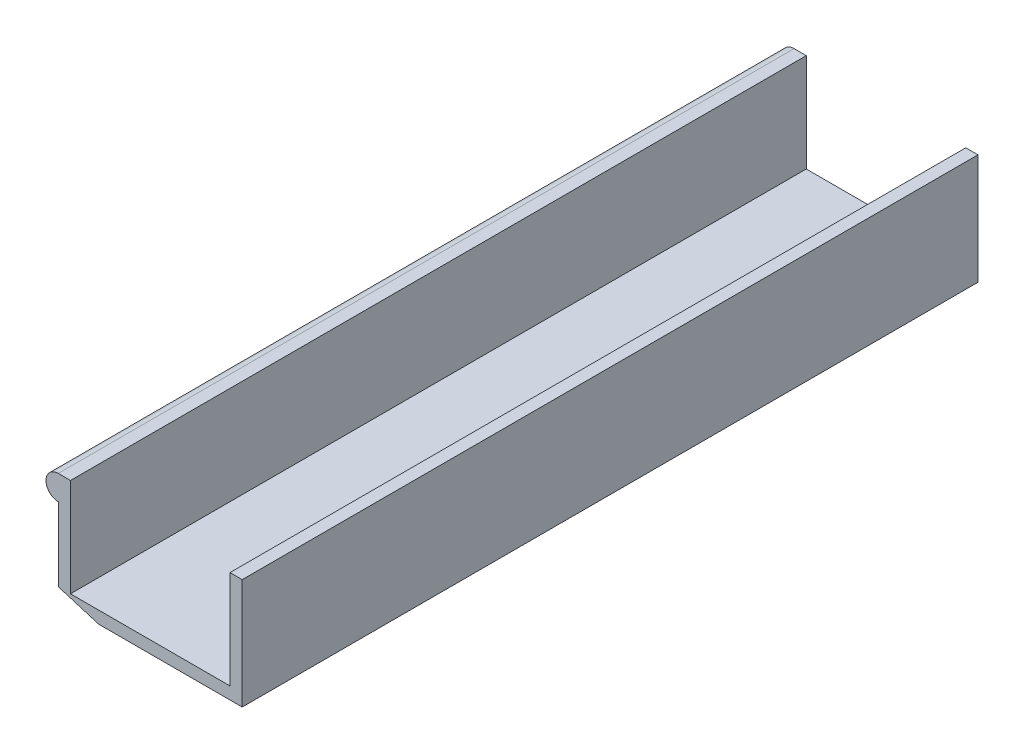
ISO-10303-21;
HEADER;
FILE_DESCRIPTION(('STEP AP214'),'2;1');
FILE_NAME('part.step','',(''),(''),'','','');
FILE_SCHEMA(('AUTOMOTIVE_DESIGN { 1 0 10303 214 1 1 1 1 }'));
ENDSEC;
DATA;
#1=APPLICATION_CONTEXT('core data for automotive mechanical design processes');
#2=APPLICATION_PROTOCOL_DEFINITION('international standard','automotive_design',2000,#1);
#3=PRODUCT_CONTEXT('',#1,'mechanical');
#4=PRODUCT('Part','Part','',(#3));
#5=PRODUCT_RELATED_PRODUCT_CATEGORY('part','',(#4));
#6=PRODUCT_DEFINITION_FORMATION('','',#4);
#7=PRODUCT_DEFINITION_CONTEXT('part definition',#1,'design');
#8=PRODUCT_DEFINITION('design','',#6,#7);
#9=PRODUCT_DEFINITION_SHAPE('','',#8);
#10=(LENGTH_UNIT() NAMED_UNIT(*) SI_UNIT(.MILLI.,.METRE.));
#11=(NAMED_UNIT(*) PLANE_ANGLE_UNIT() SI_UNIT($,.RADIAN.));
#12=(NAMED_UNIT(*) SI_UNIT($,.STERADIAN.) SOLID_ANGLE_UNIT());
#13=UNCERTAINTY_MEASURE_WITH_UNIT(LENGTH_MEASURE(1.E-05),#10,'distance_accuracy_value','');
#14=(GEOMETRIC_REPRESENTATION_CONTEXT(3) GLOBAL_UNCERTAINTY_ASSIGNED_CONTEXT((#13)) GLOBAL_UNIT_ASSIGNED_CONTEXT((#10,
#11,#12)) REPRESENTATION_CONTEXT('',''));
#15=CARTESIAN_POINT('',(0.,0.,0.));
#16=DIRECTION('',(0.,0.,1.));
#17=DIRECTION('',(1.,0.,0.));
#18=AXIS2_PLACEMENT_3D('',#15,#16,#17);
#19=CARTESIAN_POINT('',(-111.245584271897,90.0000000000001,600.));
#20=DIRECTION('',(0.,-1.,0.));
#21=DIRECTION('',(0.,0.,-1.));
#22=AXIS2_PLACEMENT_3D('',#19,#20,#21);
#23=PLANE('',#22);
#24=DIRECTION('',(-1.,0.,0.));
#25=VECTOR('',#24,1.);
#26=CARTESIAN_POINT('',(-111.245584271897,90.0000000000001,0.));
#27=LINE('',#26,#25);
#28=CARTESIAN_POINT('',(-101.294770031493,90.0000000000001,0.));
#29=VERTEX_POINT('',#28);
#30=CARTESIAN_POINT('',(-111.245584271897,90.0000000000001,0.));
#31=VERTEX_POINT('',#30);
#32=EDGE_CURVE('E140',#29,#31,#27,.T.);
#33=ORIENTED_EDGE('',*,*,#32,.T.);
#34=DIRECTION('',(0.,0.,-1.));
#35=VECTOR('',#34,1.);
#36=CARTESIAN_POINT('',(-111.245584271897,90.0000000000001,600.));
#37=LINE('',#36,#35);
#38=CARTESIAN_POINT('',(-111.245584271897,90.0000000000001,600.));
#39=VERTEX_POINT('',#38);
#40=EDGE_CURVE('E11',#39,#31,#37,.T.);
#41=ORIENTED_EDGE('',*,*,#40,.F.);
#42=DIRECTION('',(-1.,0.,0.));
#43=VECTOR('',#42,1.);
#44=CARTESIAN_POINT('',(-111.245584271897,90.0000000000001,600.));
#45=LINE('',#44,#43);
#46=CARTESIAN_POINT('',(-101.294770031493,90.0000000000001,600.));
#47=VERTEX_POINT('',#46);
#48=EDGE_CURVE('E158',#47,#39,#45,.T.);
#49=ORIENTED_EDGE('',*,*,#48,.F.);
#50=DIRECTION('',(0.,0.,-1.));
#51=VECTOR('',#50,1.);
#52=CARTESIAN_POINT('',(-101.294770031493,90.0000000000001,600.));
#53=LINE('',#52,#51);
#54=EDGE_CURVE('E136',#47,#29,#53,.T.);
#55=ORIENTED_EDGE('',*,*,#54,.T.);
#56=EDGE_LOOP('',(#33,#41,#49,#55));
#57=FACE_BOUND('',#56,.T.);
#58=ADVANCED_FACE('F32',(#57),#23,.F.);
#59=CARTESIAN_POINT('',(-111.245584271897,80.0000000000001,600.));
#60=DIRECTION('',(0.,0.,-1.));
#61=DIRECTION('',(-1.,0.,0.));
#62=AXIS2_PLACEMENT_3D('',#59,#60,#61);
#63=CYLINDRICAL_SURFACE('',#62,10.);
#64=CARTESIAN_POINT('',(-111.245584271897,80.0000000000001,0.));
#65=DIRECTION('',(0.,0.,1.));
#66=DIRECTION('',(1.,0.,0.));
#67=AXIS2_PLACEMENT_3D('',#64,#65,#66);
#68=CIRCLE('',#67,10.);
#69=CARTESIAN_POINT('',(-111.245584271897,70.0000000000001,0.));
#70=VERTEX_POINT('',#69);
#71=EDGE_CURVE('E143',#31,#70,#68,.T.);
#72=ORIENTED_EDGE('',*,*,#71,.T.);
#73=DIRECTION('',(0.,0.,-1.));
#74=VECTOR('',#73,1.);
#75=CARTESIAN_POINT('',(-111.245584271897,70.0000000000001,600.));
#76=LINE('',#75,#74);
#77=CARTESIAN_POINT('',(-111.245584271897,70.0000000000001,600.));
#78=VERTEX_POINT('',#77);
#79=EDGE_CURVE('E40',#78,#70,#76,.T.);
#80=ORIENTED_EDGE('',*,*,#79,.F.);
#81=CARTESIAN_POINT('',(-111.245584271897,80.0000000000001,600.));
#82=DIRECTION('',(0.,0.,1.));
#83=DIRECTION('',(1.,0.,0.));
#84=AXIS2_PLACEMENT_3D('',#81,#82,#83);
#85=CIRCLE('',#84,10.);
#86=EDGE_CURVE('E97',#39,#78,#85,.T.);
#87=ORIENTED_EDGE('',*,*,#86,.F.);
#88=ORIENTED_EDGE('',*,*,#40,.T.);
#89=EDGE_LOOP('',(#72,#80,#87,#88));
#90=FACE_BOUND('',#89,.T.);
#91=ADVANCED_FACE('F207',(#90),#63,.T.);
#92=CARTESIAN_POINT('',(-111.245584271897,70.0000000000001,600.));
#93=DIRECTION('',(1.,0.,0.));
#94=DIRECTION('',(0.,0.,-1.));
#95=AXIS2_PLACEMENT_3D('',#92,#93,#94);
#96=PLANE('',#95);
#97=DIRECTION('',(0.,-1.,0.));
#98=VECTOR('',#97,1.);
#99=CARTESIAN_POINT('',(-111.245584271897,70.0000000000001,0.));
#100=LINE('',#99,#98);
#101=CARTESIAN_POINT('',(-111.245584271897,9.99999999999995,0.));
#102=VERTEX_POINT('',#101);
#103=EDGE_CURVE('E145',#70,#102,#100,.T.);
#104=ORIENTED_EDGE('',*,*,#103,.T.);
#105=DIRECTION('',(0.,0.,-1.));
#106=VECTOR('',#105,1.);
#107=CARTESIAN_POINT('',(-111.245584271897,9.99999999999995,600.));
#108=LINE('',#107,#106);
#109=CARTESIAN_POINT('',(-111.245584271897,9.99999999999995,600.));
#110=VERTEX_POINT('',#109);
#111=EDGE_CURVE('E171',#110,#102,#108,.T.);
#112=ORIENTED_EDGE('',*,*,#111,.F.);
#113=DIRECTION('',(0.,-1.,0.));
#114=VECTOR('',#113,1.);
#115=CARTESIAN_POINT('',(-111.245584271897,70.0000000000001,600.));
#116=LINE('',#115,#114);
#117=EDGE_CURVE('E179',#78,#110,#116,.T.);
#118=ORIENTED_EDGE('',*,*,#117,.F.);
#119=ORIENTED_EDGE('',*,*,#79,.T.);
#120=EDGE_LOOP('',(#104,#112,#118,#119));
#121=FACE_BOUND('',#120,.T.);
#122=ADVANCED_FACE('F177',(#121),#96,.F.);
#123=CARTESIAN_POINT('',(-111.245584271897,9.99999999999995,600.));
#124=DIRECTION('',(0.290217583337057,0.956960685881086,0.));
#125=DIRECTION('',(-0.956960685881086,0.290217583337057,0.));
#126=AXIS2_PLACEMENT_3D('',#123,#124,#125);
#127=PLANE('',#126);
#128=DIRECTION('',(0.956960685881086,-0.290217583337057,0.));
#129=VECTOR('',#128,1.);
#130=CARTESIAN_POINT('',(-111.245584271897,9.99999999999995,0.));
#131=LINE('',#130,#129);
#132=CARTESIAN_POINT('',(-78.2716798351808,0.,0.));
#133=VERTEX_POINT('',#132);
#134=EDGE_CURVE('E147',#102,#133,#131,.T.);
#135=ORIENTED_EDGE('',*,*,#134,.T.);
#136=DIRECTION('',(0.,0.,-1.));
#137=VECTOR('',#136,1.);
#138=CARTESIAN_POINT('',(-78.2716798351808,0.,600.));
#139=LINE('',#138,#137);
#140=CARTESIAN_POINT('',(-78.2716798351808,0.,600.));
#141=VERTEX_POINT('',#140);
#142=EDGE_CURVE('E168',#141,#133,#139,.T.);
#143=ORIENTED_EDGE('',*,*,#142,.F.);
#144=DIRECTION('',(0.956960685881086,-0.290217583337057,0.));
#145=VECTOR('',#144,1.);
#146=CARTESIAN_POINT('',(-111.245584271897,9.99999999999995,600.));
#147=LINE('',#146,#145);
#148=EDGE_CURVE('E197',#110,#141,#147,.T.);
#149=ORIENTED_EDGE('',*,*,#148,.F.);
#150=ORIENTED_EDGE('',*,*,#111,.T.);
#151=EDGE_LOOP('',(#135,#143,#149,#150));
#152=FACE_BOUND('',#151,.T.);
#153=ADVANCED_FACE('F188',(#152),#127,.F.);
#154=CARTESIAN_POINT('',(-78.2716798351808,0.,600.));
#155=DIRECTION('',(0.,1.,0.));
#156=DIRECTION('',(-1.,0.,0.));
#157=AXIS2_PLACEMENT_3D('',#154,#155,#156);
#158=PLANE('',#157);
#159=DIRECTION('',(1.,0.,0.));
#160=VECTOR('',#159,1.);
#161=CARTESIAN_POINT('',(-78.2716798351808,0.,0.));
#162=LINE('',#161,#160);
#163=CARTESIAN_POINT('',(38.7544157281031,0.,0.));
#164=VERTEX_POINT('',#163);
#165=EDGE_CURVE('E149',#133,#164,#162,.T.);
#166=ORIENTED_EDGE('',*,*,#165,.T.);
#167=DIRECTION('',(0.,0.,-1.));
#168=VECTOR('',#167,1.);
#169=CARTESIAN_POINT('',(38.7544157281031,0.,600.));
#170=LINE('',#169,#168);
#171=CARTESIAN_POINT('',(38.7544157281031,0.,600.));
#172=VERTEX_POINT('',#171);
#173=EDGE_CURVE('E165',#172,#164,#170,.T.);
#174=ORIENTED_EDGE('',*,*,#173,.F.);
#175=DIRECTION('',(1.,0.,0.));
#176=VECTOR('',#175,1.);
#177=CARTESIAN_POINT('',(-78.2716798351808,0.,600.));
#178=LINE('',#177,#176);
#179=EDGE_CURVE('E194',#141,#172,#178,.T.);
#180=ORIENTED_EDGE('',*,*,#179,.F.);
#181=ORIENTED_EDGE('',*,*,#142,.T.);
#182=EDGE_LOOP('',(#166,#174,#180,#181));
#183=FACE_BOUND('',#182,.T.);
#184=ADVANCED_FACE('F192',(#183),#158,.F.);
#185=CARTESIAN_POINT('',(38.7544157281031,0.,600.));
#186=DIRECTION('',(-1.,0.,0.));
#187=DIRECTION('',(0.,-1.,0.));
#188=AXIS2_PLACEMENT_3D('',#185,#186,#187);
#189=PLANE('',#188);
#190=DIRECTION('',(0.,1.,0.));
#191=VECTOR('',#190,1.);
#192=CARTESIAN_POINT('',(38.7544157281031,0.,0.));
#193=LINE('',#192,#191);
#194=CARTESIAN_POINT('',(38.7544157281031,90.0000000000001,0.));
#195=VERTEX_POINT('',#194);
#196=EDGE_CURVE('E151',#164,#195,#193,.T.);
#197=ORIENTED_EDGE('',*,*,#196,.T.);
#198=DIRECTION('',(0.,0.,-1.));
#199=VECTOR('',#198,1.);
#200=CARTESIAN_POINT('',(38.7544157281031,90.0000000000001,600.));
#201=LINE('',#200,#199);
#202=CARTESIAN_POINT('',(38.7544157281031,90.0000000000001,600.));
#203=VERTEX_POINT('',#202);
#204=EDGE_CURVE('E162',#203,#195,#201,.T.);
#205=ORIENTED_EDGE('',*,*,#204,.F.);
#206=DIRECTION('',(0.,1.,0.));
#207=VECTOR('',#206,1.);
#208=CARTESIAN_POINT('',(38.7544157281031,0.,600.));
#209=LINE('',#208,#207);
#210=EDGE_CURVE('E196',#172,#203,#209,.T.);
#211=ORIENTED_EDGE('',*,*,#210,.F.);
#212=ORIENTED_EDGE('',*,*,#173,.T.);
#213=EDGE_LOOP('',(#197,#205,#211,#212));
#214=FACE_BOUND('',#213,.T.);
#215=ADVANCED_FACE('F219',(#214),#189,.F.);
#216=CARTESIAN_POINT('',(28.8036014876993,90.0000000000001,600.));
#217=DIRECTION('',(0.,-1.,0.));
#218=DIRECTION('',(0.,0.,-1.));
#219=AXIS2_PLACEMENT_3D('',#216,#217,#218);
#220=PLANE('',#219);
#221=DIRECTION('',(-1.,0.,0.));
#222=VECTOR('',#221,1.);
#223=CARTESIAN_POINT('',(28.8036014876993,90.0000000000001,0.));
#224=LINE('',#223,#222);
#225=CARTESIAN_POINT('',(28.8036014876993,90.0000000000001,0.));
#226=VERTEX_POINT('',#225);
#227=EDGE_CURVE('E153',#195,#226,#224,.T.);
#228=ORIENTED_EDGE('',*,*,#227,.T.);
#229=DIRECTION('',(0.,0.,-1.));
#230=VECTOR('',#229,1.);
#231=CARTESIAN_POINT('',(28.8036014876993,90.0000000000001,600.));
#232=LINE('',#231,#230);
#233=CARTESIAN_POINT('',(28.8036014876993,90.0000000000001,600.));
#234=VERTEX_POINT('',#233);
#235=EDGE_CURVE('E131',#234,#226,#232,.T.);
#236=ORIENTED_EDGE('',*,*,#235,.F.);
#237=DIRECTION('',(-1.,0.,0.));
#238=VECTOR('',#237,1.);
#239=CARTESIAN_POINT('',(28.8036014876993,90.0000000000001,600.));
#240=LINE('',#239,#238);
#241=EDGE_CURVE('E122',#203,#234,#240,.T.);
#242=ORIENTED_EDGE('',*,*,#241,.F.);
#243=ORIENTED_EDGE('',*,*,#204,.T.);
#244=EDGE_LOOP('',(#228,#236,#242,#243));
#245=FACE_BOUND('',#244,.T.);
#246=ADVANCED_FACE('F222',(#245),#220,.F.);
#247=CARTESIAN_POINT('',(28.8036014876993,90.0000000000001,600.));
#248=DIRECTION('',(1.,0.,0.));
#249=DIRECTION('',(0.,1.,0.));
#250=AXIS2_PLACEMENT_3D('',#247,#248,#249);
#251=PLANE('',#250);
#252=DIRECTION('',(0.,-1.,0.));
#253=VECTOR('',#252,1.);
#254=CARTESIAN_POINT('',(28.8036014876993,90.0000000000001,0.));
#255=LINE('',#254,#253);
#256=CARTESIAN_POINT('',(28.8036014876993,9.95081424040387,0.));
#257=VERTEX_POINT('',#256);
#258=EDGE_CURVE('E130',#226,#257,#255,.T.);
#259=ORIENTED_EDGE('',*,*,#258,.T.);
#260=DIRECTION('',(0.,0.,-1.));
#261=VECTOR('',#260,1.);
#262=CARTESIAN_POINT('',(28.8036014876993,9.95081424040387,600.));
#263=LINE('',#262,#261);
#264=CARTESIAN_POINT('',(28.8036014876993,9.95081424040387,600.));
#265=VERTEX_POINT('',#264);
#266=EDGE_CURVE('E127',#265,#257,#263,.T.);
#267=ORIENTED_EDGE('',*,*,#266,.F.);
#268=DIRECTION('',(0.,-1.,0.));
#269=VECTOR('',#268,1.);
#270=CARTESIAN_POINT('',(28.8036014876993,90.0000000000001,600.));
#271=LINE('',#270,#269);
#272=EDGE_CURVE('E116',#234,#265,#271,.T.);
#273=ORIENTED_EDGE('',*,*,#272,.F.);
#274=ORIENTED_EDGE('',*,*,#235,.T.);
#275=EDGE_LOOP('',(#259,#267,#273,#274));
#276=FACE_BOUND('',#275,.T.);
#277=ADVANCED_FACE('F128',(#276),#251,.F.);
#278=CARTESIAN_POINT('',(-101.294770031493,9.95081424040378,600.));
#279=DIRECTION('',(0.,-1.,0.));
#280=DIRECTION('',(1.,0.,0.));
#281=AXIS2_PLACEMENT_3D('',#278,#279,#280);
#282=PLANE('',#281);
#283=DIRECTION('',(-1.,0.,0.));
#284=VECTOR('',#283,1.);
#285=CARTESIAN_POINT('',(-101.294770031493,9.95081424040378,0.));
#286=LINE('',#285,#284);
#287=CARTESIAN_POINT('',(-101.294770031493,9.95081424040378,0.));
#288=VERTEX_POINT('',#287);
#289=EDGE_CURVE('E83',#257,#288,#286,.T.);
#290=ORIENTED_EDGE('',*,*,#289,.T.);
#291=DIRECTION('',(0.,0.,-1.));
#292=VECTOR('',#291,1.);
#293=CARTESIAN_POINT('',(-101.294770031493,9.95081424040378,600.));
#294=LINE('',#293,#292);
#295=CARTESIAN_POINT('',(-101.294770031493,9.95081424040378,600.));
#296=VERTEX_POINT('',#295);
#297=EDGE_CURVE('E132',#296,#288,#294,.T.);
#298=ORIENTED_EDGE('',*,*,#297,.F.);
#299=DIRECTION('',(-1.,0.,0.));
#300=VECTOR('',#299,1.);
#301=CARTESIAN_POINT('',(-101.294770031493,9.95081424040378,600.));
#302=LINE('',#301,#300);
#303=EDGE_CURVE('E120',#265,#296,#302,.T.);
#304=ORIENTED_EDGE('',*,*,#303,.F.);
#305=ORIENTED_EDGE('',*,*,#266,.T.);
#306=EDGE_LOOP('',(#290,#298,#304,#305));
#307=FACE_BOUND('',#306,.T.);
#308=ADVANCED_FACE('F134',(#307),#282,.F.);
#309=CARTESIAN_POINT('',(-101.294770031493,90.0000000000001,600.));
#310=DIRECTION('',(-1.,0.,0.));
#311=DIRECTION('',(0.,0.,1.));
#312=AXIS2_PLACEMENT_3D('',#309,#310,#311);
#313=PLANE('',#312);
#314=DIRECTION('',(0.,1.,0.));
#315=VECTOR('',#314,1.);
#316=CARTESIAN_POINT('',(-101.294770031493,90.0000000000001,0.));
#317=LINE('',#316,#315);
#318=EDGE_CURVE('E89',#288,#29,#317,.T.);
#319=ORIENTED_EDGE('',*,*,#318,.T.);
#320=ORIENTED_EDGE('',*,*,#54,.F.);
#321=DIRECTION('',(0.,1.,0.));
#322=VECTOR('',#321,1.);
#323=CARTESIAN_POINT('',(-101.294770031493,90.0000000000001,600.));
#324=LINE('',#323,#322);
#325=EDGE_CURVE('E48',#296,#47,#324,.T.);
#326=ORIENTED_EDGE('',*,*,#325,.F.);
#327=ORIENTED_EDGE('',*,*,#297,.T.);
#328=EDGE_LOOP('',(#319,#320,#326,#327));
#329=FACE_BOUND('',#328,.T.);
#330=ADVANCED_FACE('F231',(#329),#313,.F.);
#331=CARTESIAN_POINT('',(-111.245584271897,80.0000000000001,600.));
#332=DIRECTION('',(0.,0.,1.));
#333=DIRECTION('',(1.,0.,0.));
#334=AXIS2_PLACEMENT_3D('',#331,#332,#333);
#335=PLANE('',#334);
#336=ORIENTED_EDGE('',*,*,#48,.T.);
#337=ORIENTED_EDGE('',*,*,#86,.T.);
#338=ORIENTED_EDGE('',*,*,#117,.T.);
#339=ORIENTED_EDGE('',*,*,#148,.T.);
#340=ORIENTED_EDGE('',*,*,#179,.T.);
#341=ORIENTED_EDGE('',*,*,#210,.T.);
#342=ORIENTED_EDGE('',*,*,#241,.T.);
#343=ORIENTED_EDGE('',*,*,#272,.T.);
#344=ORIENTED_EDGE('',*,*,#303,.T.);
#345=ORIENTED_EDGE('',*,*,#325,.T.);
#346=EDGE_LOOP('',(#336,#337,#338,#339,#340,#341,#342,#343,#344,#345));
#347=FACE_BOUND('',#346,.T.);
#348=ADVANCED_FACE('F118',(#347),#335,.T.);
#349=CARTESIAN_POINT('',(-111.245584271897,80.0000000000001,0.));
#350=DIRECTION('',(0.,0.,1.));
#351=DIRECTION('',(1.,0.,0.));
#352=AXIS2_PLACEMENT_3D('',#349,#350,#351);
#353=PLANE('',#352);
#354=ORIENTED_EDGE('',*,*,#32,.F.);
#355=ORIENTED_EDGE('',*,*,#318,.F.);
#356=ORIENTED_EDGE('',*,*,#289,.F.);
#357=ORIENTED_EDGE('',*,*,#258,.F.);
#358=ORIENTED_EDGE('',*,*,#227,.F.);
#359=ORIENTED_EDGE('',*,*,#196,.F.);
#360=ORIENTED_EDGE('',*,*,#165,.F.);
#361=ORIENTED_EDGE('',*,*,#134,.F.);
#362=ORIENTED_EDGE('',*,*,#103,.F.);
#363=ORIENTED_EDGE('',*,*,#71,.F.);
#364=EDGE_LOOP('',(#354,#355,#356,#357,#358,#359,#360,#361,#362,#363));
#365=FACE_BOUND('',#364,.T.);
#366=ADVANCED_FACE('F183',(#365),#353,.F.);
#367=CLOSED_SHELL('',(#58,#91,#122,#153,#184,#215,#246,#277,#308,#330,#348,#366));
#368=MANIFOLD_SOLID_BREP('B2',#367);
#369=ADVANCED_BREP_SHAPE_REPRESENTATION('',(#18,#368),#14);
#370=SHAPE_DEFINITION_REPRESENTATION(#9,#369);
ENDSEC;
END-ISO-10303-21;
